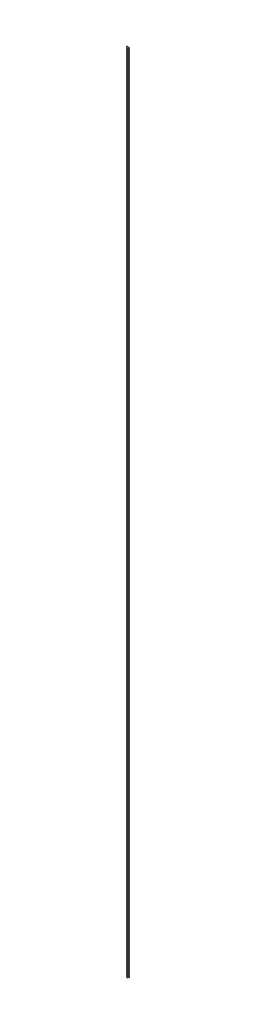
ISO-10303-21;
HEADER;
FILE_DESCRIPTION(('STEP AP214'),'2;1');
FILE_NAME('part.step','',(''),(''),'','','');
FILE_SCHEMA(('AUTOMOTIVE_DESIGN { 1 0 10303 214 1 1 1 1 }'));
ENDSEC;
DATA;
#1=APPLICATION_CONTEXT('core data for automotive mechanical design processes');
#2=APPLICATION_PROTOCOL_DEFINITION('international standard','automotive_design',2000,#1);
#3=PRODUCT_CONTEXT('',#1,'mechanical');
#4=PRODUCT('Part','Part','',(#3));
#5=PRODUCT_RELATED_PRODUCT_CATEGORY('part','',(#4));
#6=PRODUCT_DEFINITION_FORMATION('','',#4);
#7=PRODUCT_DEFINITION_CONTEXT('part definition',#1,'design');
#8=PRODUCT_DEFINITION('design','',#6,#7);
#9=PRODUCT_DEFINITION_SHAPE('','',#8);
#10=(LENGTH_UNIT() NAMED_UNIT(*) SI_UNIT(.MILLI.,.METRE.));
#11=(NAMED_UNIT(*) PLANE_ANGLE_UNIT() SI_UNIT($,.RADIAN.));
#12=(NAMED_UNIT(*) SI_UNIT($,.STERADIAN.) SOLID_ANGLE_UNIT());
#13=UNCERTAINTY_MEASURE_WITH_UNIT(LENGTH_MEASURE(1.E-05),#10,'distance_accuracy_value','');
#14=(GEOMETRIC_REPRESENTATION_CONTEXT(3) GLOBAL_UNCERTAINTY_ASSIGNED_CONTEXT((#13)) GLOBAL_UNIT_ASSIGNED_CONTEXT((#10,
#11,#12)) REPRESENTATION_CONTEXT('',''));
#15=CARTESIAN_POINT('',(0.,0.,0.));
#16=DIRECTION('',(0.,0.,1.));
#17=DIRECTION('',(1.,0.,0.));
#18=AXIS2_PLACEMENT_3D('',#15,#16,#17);
#19=CARTESIAN_POINT('',(12.7,18288.,38.1));
#20=DIRECTION('',(0.,0.,1.));
#21=DIRECTION('',(1.,0.,0.));
#22=AXIS2_PLACEMENT_3D('',#19,#20,#21);
#23=PLANE('',#22);
#24=DIRECTION('',(-1.,0.,0.));
#25=VECTOR('',#24,1.);
#26=CARTESIAN_POINT('',(12.7,0.,38.1));
#27=LINE('',#26,#25);
#28=CARTESIAN_POINT('',(12.7,0.,38.1));
#29=VERTEX_POINT('',#28);
#30=CARTESIAN_POINT('',(-12.7,0.,38.1));
#31=VERTEX_POINT('',#30);
#32=EDGE_CURVE('E142',#29,#31,#27,.T.);
#33=ORIENTED_EDGE('',*,*,#32,.F.);
#34=DIRECTION('',(0.,-1.,0.));
#35=VECTOR('',#34,1.);
#36=CARTESIAN_POINT('',(12.7,18288.,38.1));
#37=LINE('',#36,#35);
#38=CARTESIAN_POINT('',(12.7,18288.,38.1));
#39=VERTEX_POINT('',#38);
#40=EDGE_CURVE('E11',#39,#29,#37,.T.);
#41=ORIENTED_EDGE('',*,*,#40,.F.);
#42=DIRECTION('',(-1.,0.,0.));
#43=VECTOR('',#42,1.);
#44=CARTESIAN_POINT('',(12.7,18288.,38.1));
#45=LINE('',#44,#43);
#46=CARTESIAN_POINT('',(-12.7,18288.,38.1));
#47=VERTEX_POINT('',#46);
#48=EDGE_CURVE('E170',#39,#47,#45,.T.);
#49=ORIENTED_EDGE('',*,*,#48,.T.);
#50=DIRECTION('',(0.,-1.,0.));
#51=VECTOR('',#50,1.);
#52=CARTESIAN_POINT('',(-12.7,18288.,38.1));
#53=LINE('',#52,#51);
#54=EDGE_CURVE('E42',#47,#31,#53,.T.);
#55=ORIENTED_EDGE('',*,*,#54,.T.);
#56=EDGE_LOOP('',(#33,#41,#49,#55));
#57=FACE_BOUND('',#56,.T.);
#58=ADVANCED_FACE('F39',(#57),#23,.T.);
#59=CARTESIAN_POINT('',(12.7,18288.,12.7));
#60=DIRECTION('',(1.,0.,0.));
#61=DIRECTION('',(0.,0.,-1.));
#62=AXIS2_PLACEMENT_3D('',#59,#60,#61);
#63=PLANE('',#62);
#64=DIRECTION('',(0.,0.,1.));
#65=VECTOR('',#64,1.);
#66=CARTESIAN_POINT('',(12.7,0.,12.7));
#67=LINE('',#66,#65);
#68=CARTESIAN_POINT('',(12.7,0.,12.7));
#69=VERTEX_POINT('',#68);
#70=EDGE_CURVE('E167',#69,#29,#67,.T.);
#71=ORIENTED_EDGE('',*,*,#70,.F.);
#72=DIRECTION('',(0.,-1.,0.));
#73=VECTOR('',#72,1.);
#74=CARTESIAN_POINT('',(12.7,18288.,12.7));
#75=LINE('',#74,#73);
#76=CARTESIAN_POINT('',(12.7,18288.,12.7));
#77=VERTEX_POINT('',#76);
#78=EDGE_CURVE('E49',#77,#69,#75,.T.);
#79=ORIENTED_EDGE('',*,*,#78,.F.);
#80=DIRECTION('',(0.,0.,1.));
#81=VECTOR('',#80,1.);
#82=CARTESIAN_POINT('',(12.7,18288.,12.7));
#83=LINE('',#82,#81);
#84=EDGE_CURVE('E128',#77,#39,#83,.T.);
#85=ORIENTED_EDGE('',*,*,#84,.T.);
#86=ORIENTED_EDGE('',*,*,#40,.T.);
#87=EDGE_LOOP('',(#71,#79,#85,#86));
#88=FACE_BOUND('',#87,.T.);
#89=ADVANCED_FACE('F188',(#88),#63,.T.);
#90=CARTESIAN_POINT('',(31.75,18288.,12.7));
#91=DIRECTION('',(0.,0.,1.));
#92=DIRECTION('',(1.,0.,0.));
#93=AXIS2_PLACEMENT_3D('',#90,#91,#92);
#94=PLANE('',#93);
#95=DIRECTION('',(-1.,0.,0.));
#96=VECTOR('',#95,1.);
#97=CARTESIAN_POINT('',(31.75,0.,12.7));
#98=LINE('',#97,#96);
#99=CARTESIAN_POINT('',(31.75,0.,12.7));
#100=VERTEX_POINT('',#99);
#101=EDGE_CURVE('E114',#100,#69,#98,.T.);
#102=ORIENTED_EDGE('',*,*,#101,.F.);
#103=DIRECTION('',(0.,-1.,0.));
#104=VECTOR('',#103,1.);
#105=CARTESIAN_POINT('',(31.75,18288.,12.7));
#106=LINE('',#105,#104);
#107=CARTESIAN_POINT('',(31.75,18288.,12.7));
#108=VERTEX_POINT('',#107);
#109=EDGE_CURVE('E109',#108,#100,#106,.T.);
#110=ORIENTED_EDGE('',*,*,#109,.F.);
#111=DIRECTION('',(-1.,0.,0.));
#112=VECTOR('',#111,1.);
#113=CARTESIAN_POINT('',(31.75,18288.,12.7));
#114=LINE('',#113,#112);
#115=EDGE_CURVE('E112',#108,#77,#114,.T.);
#116=ORIENTED_EDGE('',*,*,#115,.T.);
#117=ORIENTED_EDGE('',*,*,#78,.T.);
#118=EDGE_LOOP('',(#102,#110,#116,#117));
#119=FACE_BOUND('',#118,.T.);
#120=ADVANCED_FACE('F111',(#119),#94,.T.);
#121=CARTESIAN_POINT('',(31.75,18288.,6.35));
#122=DIRECTION('',(1.,0.,0.));
#123=DIRECTION('',(0.,0.,-1.));
#124=AXIS2_PLACEMENT_3D('',#121,#122,#123);
#125=PLANE('',#124);
#126=DIRECTION('',(0.,0.,1.));
#127=VECTOR('',#126,1.);
#128=CARTESIAN_POINT('',(31.75,0.,6.35));
#129=LINE('',#128,#127);
#130=CARTESIAN_POINT('',(31.75,0.,6.35));
#131=VERTEX_POINT('',#130);
#132=EDGE_CURVE('E162',#131,#100,#129,.T.);
#133=ORIENTED_EDGE('',*,*,#132,.F.);
#134=DIRECTION('',(0.,-1.,0.));
#135=VECTOR('',#134,1.);
#136=CARTESIAN_POINT('',(31.75,18288.,6.35));
#137=LINE('',#136,#135);
#138=CARTESIAN_POINT('',(31.75,18288.,6.35));
#139=VERTEX_POINT('',#138);
#140=EDGE_CURVE('E120',#139,#131,#137,.T.);
#141=ORIENTED_EDGE('',*,*,#140,.F.);
#142=DIRECTION('',(0.,0.,1.));
#143=VECTOR('',#142,1.);
#144=CARTESIAN_POINT('',(31.75,18288.,6.35));
#145=LINE('',#144,#143);
#146=EDGE_CURVE('E126',#139,#108,#145,.T.);
#147=ORIENTED_EDGE('',*,*,#146,.T.);
#148=ORIENTED_EDGE('',*,*,#109,.T.);
#149=EDGE_LOOP('',(#133,#141,#147,#148));
#150=FACE_BOUND('',#149,.T.);
#151=ADVANCED_FACE('F131',(#150),#125,.T.);
#152=CARTESIAN_POINT('',(-31.75,18288.,6.35));
#153=DIRECTION('',(0.,0.,-1.));
#154=DIRECTION('',(-1.,0.,0.));
#155=AXIS2_PLACEMENT_3D('',#152,#153,#154);
#156=PLANE('',#155);
#157=DIRECTION('',(1.,0.,0.));
#158=VECTOR('',#157,1.);
#159=CARTESIAN_POINT('',(-31.75,0.,6.35));
#160=LINE('',#159,#158);
#161=CARTESIAN_POINT('',(-31.75,0.,6.35));
#162=VERTEX_POINT('',#161);
#163=EDGE_CURVE('E158',#162,#131,#160,.T.);
#164=ORIENTED_EDGE('',*,*,#163,.F.);
#165=DIRECTION('',(0.,-1.,0.));
#166=VECTOR('',#165,1.);
#167=CARTESIAN_POINT('',(-31.75,18288.,6.35));
#168=LINE('',#167,#166);
#169=CARTESIAN_POINT('',(-31.75,18288.,6.35));
#170=VERTEX_POINT('',#169);
#171=EDGE_CURVE('E176',#170,#162,#168,.T.);
#172=ORIENTED_EDGE('',*,*,#171,.F.);
#173=DIRECTION('',(1.,0.,0.));
#174=VECTOR('',#173,1.);
#175=CARTESIAN_POINT('',(-31.75,18288.,6.35));
#176=LINE('',#175,#174);
#177=EDGE_CURVE('E133',#170,#139,#176,.T.);
#178=ORIENTED_EDGE('',*,*,#177,.T.);
#179=ORIENTED_EDGE('',*,*,#140,.T.);
#180=EDGE_LOOP('',(#164,#172,#178,#179));
#181=FACE_BOUND('',#180,.T.);
#182=ADVANCED_FACE('F201',(#181),#156,.T.);
#183=CARTESIAN_POINT('',(-31.75,18288.,12.7));
#184=DIRECTION('',(-1.,0.,0.));
#185=DIRECTION('',(0.,0.,1.));
#186=AXIS2_PLACEMENT_3D('',#183,#184,#185);
#187=PLANE('',#186);
#188=DIRECTION('',(0.,0.,-1.));
#189=VECTOR('',#188,1.);
#190=CARTESIAN_POINT('',(-31.75,0.,12.7));
#191=LINE('',#190,#189);
#192=CARTESIAN_POINT('',(-31.75,0.,12.7));
#193=VERTEX_POINT('',#192);
#194=EDGE_CURVE('E154',#193,#162,#191,.T.);
#195=ORIENTED_EDGE('',*,*,#194,.F.);
#196=DIRECTION('',(0.,-1.,0.));
#197=VECTOR('',#196,1.);
#198=CARTESIAN_POINT('',(-31.75,18288.,12.7));
#199=LINE('',#198,#197);
#200=CARTESIAN_POINT('',(-31.75,18288.,12.7));
#201=VERTEX_POINT('',#200);
#202=EDGE_CURVE('E179',#201,#193,#199,.T.);
#203=ORIENTED_EDGE('',*,*,#202,.F.);
#204=DIRECTION('',(0.,0.,-1.));
#205=VECTOR('',#204,1.);
#206=CARTESIAN_POINT('',(-31.75,18288.,12.7));
#207=LINE('',#206,#205);
#208=EDGE_CURVE('E136',#201,#170,#207,.T.);
#209=ORIENTED_EDGE('',*,*,#208,.T.);
#210=ORIENTED_EDGE('',*,*,#171,.T.);
#211=EDGE_LOOP('',(#195,#203,#209,#210));
#212=FACE_BOUND('',#211,.T.);
#213=ADVANCED_FACE('F204',(#212),#187,.T.);
#214=CARTESIAN_POINT('',(-12.7,18288.,12.7));
#215=DIRECTION('',(0.,0.,1.));
#216=DIRECTION('',(1.,0.,0.));
#217=AXIS2_PLACEMENT_3D('',#214,#215,#216);
#218=PLANE('',#217);
#219=DIRECTION('',(-1.,0.,0.));
#220=VECTOR('',#219,1.);
#221=CARTESIAN_POINT('',(-12.7,0.,12.7));
#222=LINE('',#221,#220);
#223=CARTESIAN_POINT('',(-12.7,0.,12.7));
#224=VERTEX_POINT('',#223);
#225=EDGE_CURVE('E150',#224,#193,#222,.T.);
#226=ORIENTED_EDGE('',*,*,#225,.F.);
#227=DIRECTION('',(0.,-1.,0.));
#228=VECTOR('',#227,1.);
#229=CARTESIAN_POINT('',(-12.7,18288.,12.7));
#230=LINE('',#229,#228);
#231=CARTESIAN_POINT('',(-12.7,18288.,12.7));
#232=VERTEX_POINT('',#231);
#233=EDGE_CURVE('E181',#232,#224,#230,.T.);
#234=ORIENTED_EDGE('',*,*,#233,.F.);
#235=DIRECTION('',(-1.,0.,0.));
#236=VECTOR('',#235,1.);
#237=CARTESIAN_POINT('',(-12.7,18288.,12.7));
#238=LINE('',#237,#236);
#239=EDGE_CURVE('E279',#232,#201,#238,.T.);
#240=ORIENTED_EDGE('',*,*,#239,.T.);
#241=ORIENTED_EDGE('',*,*,#202,.T.);
#242=EDGE_LOOP('',(#226,#234,#240,#241));
#243=FACE_BOUND('',#242,.T.);
#244=ADVANCED_FACE('F208',(#243),#218,.T.);
#245=CARTESIAN_POINT('',(-12.7,18288.,38.1));
#246=DIRECTION('',(-1.,0.,0.));
#247=DIRECTION('',(0.,0.,1.));
#248=AXIS2_PLACEMENT_3D('',#245,#246,#247);
#249=PLANE('',#248);
#250=DIRECTION('',(0.,0.,-1.));
#251=VECTOR('',#250,1.);
#252=CARTESIAN_POINT('',(-12.7,0.,38.1));
#253=LINE('',#252,#251);
#254=EDGE_CURVE('E146',#31,#224,#253,.T.);
#255=ORIENTED_EDGE('',*,*,#254,.F.);
#256=ORIENTED_EDGE('',*,*,#54,.F.);
#257=DIRECTION('',(0.,0.,-1.));
#258=VECTOR('',#257,1.);
#259=CARTESIAN_POINT('',(-12.7,18288.,38.1));
#260=LINE('',#259,#258);
#261=EDGE_CURVE('E282',#47,#232,#260,.T.);
#262=ORIENTED_EDGE('',*,*,#261,.T.);
#263=ORIENTED_EDGE('',*,*,#233,.T.);
#264=EDGE_LOOP('',(#255,#256,#262,#263));
#265=FACE_BOUND('',#264,.T.);
#266=ADVANCED_FACE('F185',(#265),#249,.T.);
#267=CARTESIAN_POINT('',(0.,18288.,0.));
#268=DIRECTION('',(0.,-1.,0.));
#269=DIRECTION('',(0.,0.,-1.));
#270=AXIS2_PLACEMENT_3D('',#267,#268,#269);
#271=PLANE('',#270);
#272=ORIENTED_EDGE('',*,*,#48,.F.);
#273=ORIENTED_EDGE('',*,*,#84,.F.);
#274=ORIENTED_EDGE('',*,*,#115,.F.);
#275=ORIENTED_EDGE('',*,*,#146,.F.);
#276=ORIENTED_EDGE('',*,*,#177,.F.);
#277=ORIENTED_EDGE('',*,*,#208,.F.);
#278=ORIENTED_EDGE('',*,*,#239,.F.);
#279=ORIENTED_EDGE('',*,*,#261,.F.);
#280=EDGE_LOOP('',(#272,#273,#274,#275,#276,#277,#278,#279));
#281=FACE_BOUND('',#280,.T.);
#282=ADVANCED_FACE('F124',(#281),#271,.F.);
#283=CARTESIAN_POINT('',(0.,0.,0.));
#284=DIRECTION('',(0.,-1.,0.));
#285=DIRECTION('',(0.,0.,-1.));
#286=AXIS2_PLACEMENT_3D('',#283,#284,#285);
#287=PLANE('',#286);
#288=ORIENTED_EDGE('',*,*,#32,.T.);
#289=ORIENTED_EDGE('',*,*,#254,.T.);
#290=ORIENTED_EDGE('',*,*,#225,.T.);
#291=ORIENTED_EDGE('',*,*,#194,.T.);
#292=ORIENTED_EDGE('',*,*,#163,.T.);
#293=ORIENTED_EDGE('',*,*,#132,.T.);
#294=ORIENTED_EDGE('',*,*,#101,.T.);
#295=ORIENTED_EDGE('',*,*,#70,.T.);
#296=EDGE_LOOP('',(#288,#289,#290,#291,#292,#293,#294,#295));
#297=FACE_BOUND('',#296,.T.);
#298=ADVANCED_FACE('F187',(#297),#287,.T.);
#299=CLOSED_SHELL('',(#58,#89,#120,#151,#182,#213,#244,#266,#282,#298));
#300=MANIFOLD_SOLID_BREP('B2',#299);
#301=ADVANCED_BREP_SHAPE_REPRESENTATION('',(#18,#300),#14);
#302=SHAPE_DEFINITION_REPRESENTATION(#9,#301);
ENDSEC;
END-ISO-10303-21;
